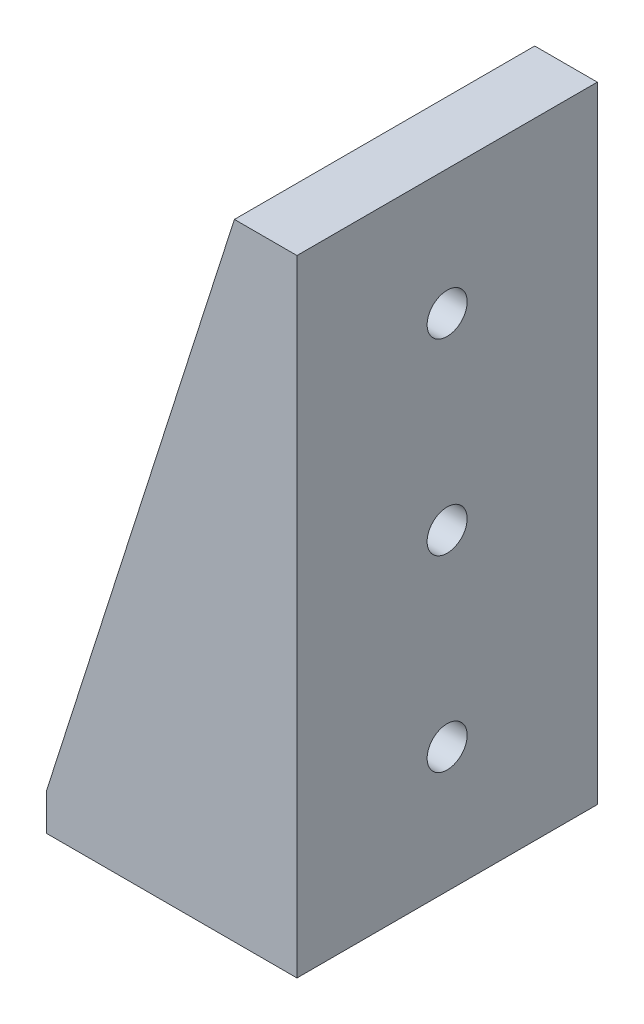
ISO-10303-21;
HEADER;
FILE_DESCRIPTION(('STEP AP214'),'2;1');
FILE_NAME('part.step','',(''),(''),'','','');
FILE_SCHEMA(('AUTOMOTIVE_DESIGN { 1 0 10303 214 1 1 1 1 }'));
ENDSEC;
DATA;
#1=APPLICATION_CONTEXT('core data for automotive mechanical design processes');
#2=APPLICATION_PROTOCOL_DEFINITION('international standard','automotive_design',2000,#1);
#3=PRODUCT_CONTEXT('',#1,'mechanical');
#4=PRODUCT('Part','Part','',(#3));
#5=PRODUCT_RELATED_PRODUCT_CATEGORY('part','',(#4));
#6=PRODUCT_DEFINITION_FORMATION('','',#4);
#7=PRODUCT_DEFINITION_CONTEXT('part definition',#1,'design');
#8=PRODUCT_DEFINITION('design','',#6,#7);
#9=PRODUCT_DEFINITION_SHAPE('','',#8);
#10=(LENGTH_UNIT() NAMED_UNIT(*) SI_UNIT(.MILLI.,.METRE.));
#11=(NAMED_UNIT(*) PLANE_ANGLE_UNIT() SI_UNIT($,.RADIAN.));
#12=(NAMED_UNIT(*) SI_UNIT($,.STERADIAN.) SOLID_ANGLE_UNIT());
#13=UNCERTAINTY_MEASURE_WITH_UNIT(LENGTH_MEASURE(1.E-05),#10,'distance_accuracy_value','');
#14=(GEOMETRIC_REPRESENTATION_CONTEXT(3) GLOBAL_UNCERTAINTY_ASSIGNED_CONTEXT((#13)) GLOBAL_UNIT_ASSIGNED_CONTEXT((#10,
#11,#12)) REPRESENTATION_CONTEXT('',''));
#15=CARTESIAN_POINT('',(0.,0.,0.));
#16=DIRECTION('',(0.,0.,1.));
#17=DIRECTION('',(1.,0.,0.));
#18=AXIS2_PLACEMENT_3D('',#15,#16,#17);
#19=CARTESIAN_POINT('',(-10.,3.,24.));
#20=DIRECTION('',(0.952659211218683,-0.304040173793197,0.));
#21=DIRECTION('',(0.304040173793197,0.952659211218683,0.));
#22=AXIS2_PLACEMENT_3D('',#19,#20,#21);
#23=PLANE('',#22);
#24=DIRECTION('',(0.,0.,-1.));
#25=VECTOR('',#24,1.);
#26=CARTESIAN_POINT('',(5.,50.,24.));
#27=LINE('',#26,#25);
#28=CARTESIAN_POINT('',(5.,50.,24.));
#29=VERTEX_POINT('',#28);
#30=CARTESIAN_POINT('',(5.,50.,21.5));
#31=VERTEX_POINT('',#30);
#32=EDGE_CURVE('E255',#29,#31,#27,.T.);
#33=ORIENTED_EDGE('',*,*,#32,.T.);
#34=DIRECTION('',(-0.304040173793197,-0.952659211218683,0.));
#35=VECTOR('',#34,1.);
#36=CARTESIAN_POINT('',(-10.,3.,21.5));
#37=LINE('',#36,#35);
#38=CARTESIAN_POINT('',(-9.68128901761478,3.99862774480702,21.5));
#39=VERTEX_POINT('',#38);
#40=EDGE_CURVE('E221',#31,#39,#37,.T.);
#41=ORIENTED_EDGE('',*,*,#40,.T.);
#42=CARTESIAN_POINT('',(-9.68128901761478,3.99862774480702,20.5));
#43=DIRECTION('',(0.952659211218683,-0.304040173793197,0.));
#44=DIRECTION('',(0.304040173793197,0.952659211218683,0.));
#45=AXIS2_PLACEMENT_3D('',#42,#43,#44);
#46=ELLIPSE('',#45,1.04969330923779,1.);
#47=CARTESIAN_POINT('',(-10.,3.,20.5523700993091));
#48=VERTEX_POINT('',#47);
#49=EDGE_CURVE('E275',#39,#48,#46,.T.);
#50=ORIENTED_EDGE('',*,*,#49,.T.);
#51=DIRECTION('',(0.,0.,-1.));
#52=VECTOR('',#51,1.);
#53=CARTESIAN_POINT('',(-10.,3.,24.));
#54=LINE('',#53,#52);
#55=CARTESIAN_POINT('',(-10.,3.,24.));
#56=VERTEX_POINT('',#55);
#57=EDGE_CURVE('E60',#56,#48,#54,.T.);
#58=ORIENTED_EDGE('',*,*,#57,.F.);
#59=DIRECTION('',(-0.304040173793197,-0.952659211218683,0.));
#60=VECTOR('',#59,1.);
#61=CARTESIAN_POINT('',(-10.,3.,24.));
#62=LINE('',#61,#60);
#63=EDGE_CURVE('E231',#29,#56,#62,.T.);
#64=ORIENTED_EDGE('',*,*,#63,.F.);
#65=EDGE_LOOP('',(#33,#41,#50,#58,#64));
#66=FACE_BOUND('',#65,.T.);
#67=ADVANCED_FACE('F36',(#66),#23,.F.);
#68=CARTESIAN_POINT('',(10.,0.,24.));
#69=DIRECTION('',(-1.,0.,0.));
#70=DIRECTION('',(0.,0.,1.));
#71=AXIS2_PLACEMENT_3D('',#68,#69,#70);
#72=PLANE('',#71);
#73=CARTESIAN_POINT('',(10.,10.,12.));
#74=DIRECTION('',(1.,0.,0.));
#75=DIRECTION('',(0.,0.,-1.));
#76=AXIS2_PLACEMENT_3D('',#73,#74,#75);
#77=CIRCLE('',#76,1.6);
#78=CARTESIAN_POINT('',(10.,10.,10.4));
#79=VERTEX_POINT('',#78);
#80=EDGE_CURVE('E190',#79,#79,#77,.T.);
#81=ORIENTED_EDGE('',*,*,#80,.F.);
#82=EDGE_LOOP('',(#81));
#83=FACE_BOUND('',#82,.T.);
#84=CARTESIAN_POINT('',(10.,25.,12.));
#85=DIRECTION('',(1.,0.,0.));
#86=DIRECTION('',(0.,0.,-1.));
#87=AXIS2_PLACEMENT_3D('',#84,#85,#86);
#88=CIRCLE('',#87,1.6);
#89=CARTESIAN_POINT('',(10.,25.,10.4));
#90=VERTEX_POINT('',#89);
#91=EDGE_CURVE('E197',#90,#90,#88,.T.);
#92=ORIENTED_EDGE('',*,*,#91,.F.);
#93=EDGE_LOOP('',(#92));
#94=FACE_BOUND('',#93,.T.);
#95=CARTESIAN_POINT('',(10.,40.,12.));
#96=DIRECTION('',(1.,0.,0.));
#97=DIRECTION('',(0.,0.,-1.));
#98=AXIS2_PLACEMENT_3D('',#95,#96,#97);
#99=CIRCLE('',#98,1.6);
#100=CARTESIAN_POINT('',(10.,40.,10.4));
#101=VERTEX_POINT('',#100);
#102=EDGE_CURVE('E203',#101,#101,#99,.T.);
#103=ORIENTED_EDGE('',*,*,#102,.F.);
#104=EDGE_LOOP('',(#103));
#105=FACE_BOUND('',#104,.T.);
#106=DIRECTION('',(0.,1.,0.));
#107=VECTOR('',#106,1.);
#108=CARTESIAN_POINT('',(10.,0.,0.));
#109=LINE('',#108,#107);
#110=CARTESIAN_POINT('',(10.,0.,0.));
#111=VERTEX_POINT('',#110);
#112=CARTESIAN_POINT('',(10.,50.,0.));
#113=VERTEX_POINT('',#112);
#114=EDGE_CURVE('E224',#111,#113,#109,.T.);
#115=ORIENTED_EDGE('',*,*,#114,.T.);
#116=DIRECTION('',(0.,0.,-1.));
#117=VECTOR('',#116,1.);
#118=CARTESIAN_POINT('',(10.,50.,24.));
#119=LINE('',#118,#117);
#120=CARTESIAN_POINT('',(10.,50.,24.));
#121=VERTEX_POINT('',#120);
#122=EDGE_CURVE('E258',#121,#113,#119,.T.);
#123=ORIENTED_EDGE('',*,*,#122,.F.);
#124=DIRECTION('',(0.,1.,0.));
#125=VECTOR('',#124,1.);
#126=CARTESIAN_POINT('',(10.,0.,24.));
#127=LINE('',#126,#125);
#128=CARTESIAN_POINT('',(10.,0.,24.));
#129=VERTEX_POINT('',#128);
#130=EDGE_CURVE('E225',#129,#121,#127,.T.);
#131=ORIENTED_EDGE('',*,*,#130,.F.);
#132=DIRECTION('',(0.,0.,-1.));
#133=VECTOR('',#132,1.);
#134=CARTESIAN_POINT('',(10.,0.,24.));
#135=LINE('',#134,#133);
#136=EDGE_CURVE('E237',#129,#111,#135,.T.);
#137=ORIENTED_EDGE('',*,*,#136,.T.);
#138=EDGE_LOOP('',(#115,#123,#131,#137));
#139=FACE_BOUND('',#138,.T.);
#140=ADVANCED_FACE('F335',(#83,#94,#105,#139),#72,.F.);
#141=CARTESIAN_POINT('',(5.,50.,24.));
#142=DIRECTION('',(0.,-1.,0.));
#143=DIRECTION('',(0.,0.,-1.));
#144=AXIS2_PLACEMENT_3D('',#141,#142,#143);
#145=PLANE('',#144);
#146=DIRECTION('',(-1.,0.,0.));
#147=VECTOR('',#146,1.);
#148=CARTESIAN_POINT('',(5.,50.,0.));
#149=LINE('',#148,#147);
#150=CARTESIAN_POINT('',(5.,50.,0.));
#151=VERTEX_POINT('',#150);
#152=EDGE_CURVE('E240',#113,#151,#149,.T.);
#153=ORIENTED_EDGE('',*,*,#152,.T.);
#154=CARTESIAN_POINT('',(5.,50.,2.5));
#155=VERTEX_POINT('',#154);
#156=EDGE_CURVE('E254',#155,#151,#27,.T.);
#157=ORIENTED_EDGE('',*,*,#156,.F.);
#158=DIRECTION('',(0.,0.,-1.));
#159=VECTOR('',#158,1.);
#160=CARTESIAN_POINT('',(5.,50.,2.5));
#161=LINE('',#160,#159);
#162=EDGE_CURVE('E210',#31,#155,#161,.T.);
#163=ORIENTED_EDGE('',*,*,#162,.F.);
#164=ORIENTED_EDGE('',*,*,#32,.F.);
#165=DIRECTION('',(-1.,0.,0.));
#166=VECTOR('',#165,1.);
#167=CARTESIAN_POINT('',(5.,50.,24.));
#168=LINE('',#167,#166);
#169=EDGE_CURVE('E228',#121,#29,#168,.T.);
#170=ORIENTED_EDGE('',*,*,#169,.F.);
#171=ORIENTED_EDGE('',*,*,#122,.T.);
#172=EDGE_LOOP('',(#153,#157,#163,#164,#170,#171));
#173=FACE_BOUND('',#172,.T.);
#174=ADVANCED_FACE('F325',(#173),#145,.F.);
#175=CARTESIAN_POINT('',(-10.,3.,3.44762990069088));
#176=VERTEX_POINT('',#175);
#177=CARTESIAN_POINT('',(-10.,3.,0.));
#178=VERTEX_POINT('',#177);
#179=EDGE_CURVE('E52',#176,#178,#54,.T.);
#180=ORIENTED_EDGE('',*,*,#179,.F.);
#181=CARTESIAN_POINT('',(-9.68128901761478,3.99862774480702,3.5));
#182=DIRECTION('',(0.952659211218683,-0.304040173793197,0.));
#183=DIRECTION('',(0.304040173793197,0.952659211218683,0.));
#184=AXIS2_PLACEMENT_3D('',#181,#182,#183);
#185=ELLIPSE('',#184,1.04969330923779,1.);
#186=CARTESIAN_POINT('',(-9.68128901761478,3.99862774480702,2.5));
#187=VERTEX_POINT('',#186);
#188=EDGE_CURVE('E11',#176,#187,#185,.T.);
#189=ORIENTED_EDGE('',*,*,#188,.T.);
#190=DIRECTION('',(0.304040173793197,0.952659211218683,0.));
#191=VECTOR('',#190,1.);
#192=CARTESIAN_POINT('',(-10.,3.,2.5));
#193=LINE('',#192,#191);
#194=EDGE_CURVE('E218',#187,#155,#193,.T.);
#195=ORIENTED_EDGE('',*,*,#194,.T.);
#196=ORIENTED_EDGE('',*,*,#156,.T.);
#197=DIRECTION('',(-0.304040173793197,-0.952659211218683,0.));
#198=VECTOR('',#197,1.);
#199=CARTESIAN_POINT('',(-10.,3.,0.));
#200=LINE('',#199,#198);
#201=EDGE_CURVE('E243',#151,#178,#200,.T.);
#202=ORIENTED_EDGE('',*,*,#201,.T.);
#203=EDGE_LOOP('',(#180,#189,#195,#196,#202));
#204=FACE_BOUND('',#203,.T.);
#205=ADVANCED_FACE('F341',(#204),#23,.F.);
#206=CARTESIAN_POINT('',(-10.,0.,24.));
#207=DIRECTION('',(1.,0.,0.));
#208=DIRECTION('',(0.,0.,-1.));
#209=AXIS2_PLACEMENT_3D('',#206,#207,#208);
#210=PLANE('',#209);
#211=ORIENTED_EDGE('',*,*,#57,.T.);
#212=CARTESIAN_POINT('',(-10.,3.99862774480702,20.5));
#213=DIRECTION('',(1.,0.,0.));
#214=DIRECTION('',(0.,0.,-1.));
#215=AXIS2_PLACEMENT_3D('',#212,#213,#214);
#216=CIRCLE('',#215,1.);
#217=CARTESIAN_POINT('',(-10.,2.99862774480702,20.5));
#218=VERTEX_POINT('',#217);
#219=EDGE_CURVE('E277',#48,#218,#216,.T.);
#220=ORIENTED_EDGE('',*,*,#219,.T.);
#221=DIRECTION('',(0.,0.,1.));
#222=VECTOR('',#221,1.);
#223=CARTESIAN_POINT('',(-10.,2.99862774480702,2.5));
#224=LINE('',#223,#222);
#225=CARTESIAN_POINT('',(-10.,2.99862774480702,3.5));
#226=VERTEX_POINT('',#225);
#227=EDGE_CURVE('E209',#226,#218,#224,.T.);
#228=ORIENTED_EDGE('',*,*,#227,.F.);
#229=CARTESIAN_POINT('',(-10.,3.99862774480702,3.5));
#230=DIRECTION('',(1.,0.,0.));
#231=DIRECTION('',(0.,0.,-1.));
#232=AXIS2_PLACEMENT_3D('',#229,#230,#231);
#233=CIRCLE('',#232,1.);
#234=EDGE_CURVE('E45',#226,#176,#233,.T.);
#235=ORIENTED_EDGE('',*,*,#234,.T.);
#236=ORIENTED_EDGE('',*,*,#179,.T.);
#237=DIRECTION('',(0.,-1.,0.));
#238=VECTOR('',#237,1.);
#239=CARTESIAN_POINT('',(-10.,0.,0.));
#240=LINE('',#239,#238);
#241=CARTESIAN_POINT('',(-10.,0.,0.));
#242=VERTEX_POINT('',#241);
#243=EDGE_CURVE('E245',#178,#242,#240,.T.);
#244=ORIENTED_EDGE('',*,*,#243,.T.);
#245=DIRECTION('',(0.,0.,-1.));
#246=VECTOR('',#245,1.);
#247=CARTESIAN_POINT('',(-10.,0.,24.));
#248=LINE('',#247,#246);
#249=CARTESIAN_POINT('',(-10.,0.,24.));
#250=VERTEX_POINT('',#249);
#251=EDGE_CURVE('E250',#250,#242,#248,.T.);
#252=ORIENTED_EDGE('',*,*,#251,.F.);
#253=DIRECTION('',(0.,-1.,0.));
#254=VECTOR('',#253,1.);
#255=CARTESIAN_POINT('',(-10.,0.,24.));
#256=LINE('',#255,#254);
#257=EDGE_CURVE('E233',#56,#250,#256,.T.);
#258=ORIENTED_EDGE('',*,*,#257,.F.);
#259=EDGE_LOOP('',(#211,#220,#228,#235,#236,#244,#252,#258));
#260=FACE_BOUND('',#259,.T.);
#261=ADVANCED_FACE('F307',(#260),#210,.F.);
#262=CARTESIAN_POINT('',(-10.,0.,24.));
#263=DIRECTION('',(0.,1.,0.));
#264=DIRECTION('',(-1.,0.,0.));
#265=AXIS2_PLACEMENT_3D('',#262,#263,#264);
#266=PLANE('',#265);
#267=DIRECTION('',(1.,0.,0.));
#268=VECTOR('',#267,1.);
#269=CARTESIAN_POINT('',(-7.,0.,11.));
#270=LINE('',#269,#268);
#271=CARTESIAN_POINT('',(-7.,0.,11.));
#272=VERTEX_POINT('',#271);
#273=CARTESIAN_POINT('',(3.,0.,11.));
#274=VERTEX_POINT('',#273);
#275=EDGE_CURVE('E289',#272,#274,#270,.T.);
#276=ORIENTED_EDGE('',*,*,#275,.F.);
#277=CARTESIAN_POINT('',(-7.,0.,12.));
#278=DIRECTION('',(0.,1.,0.));
#279=DIRECTION('',(-1.,0.,0.));
#280=AXIS2_PLACEMENT_3D('',#277,#278,#279);
#281=CIRCLE('',#280,1.);
#282=CARTESIAN_POINT('',(-7.,0.,13.));
#283=VERTEX_POINT('',#282);
#284=EDGE_CURVE('E191',#283,#272,#281,.F.);
#285=ORIENTED_EDGE('',*,*,#284,.F.);
#286=DIRECTION('',(-1.,0.,0.));
#287=VECTOR('',#286,1.);
#288=CARTESIAN_POINT('',(-7.,0.,13.));
#289=LINE('',#288,#287);
#290=CARTESIAN_POINT('',(3.,0.,13.));
#291=VERTEX_POINT('',#290);
#292=EDGE_CURVE('E188',#291,#283,#289,.T.);
#293=ORIENTED_EDGE('',*,*,#292,.F.);
#294=CARTESIAN_POINT('',(3.,0.,12.));
#295=DIRECTION('',(0.,1.,0.));
#296=DIRECTION('',(-1.,0.,0.));
#297=AXIS2_PLACEMENT_3D('',#294,#295,#296);
#298=CIRCLE('',#297,1.);
#299=EDGE_CURVE('E156',#274,#291,#298,.F.);
#300=ORIENTED_EDGE('',*,*,#299,.F.);
#301=EDGE_LOOP('',(#276,#285,#293,#300));
#302=FACE_BOUND('',#301,.T.);
#303=DIRECTION('',(1.,0.,0.));
#304=VECTOR('',#303,1.);
#305=CARTESIAN_POINT('',(-10.,0.,0.));
#306=LINE('',#305,#304);
#307=EDGE_CURVE('E229',#242,#111,#306,.T.);
#308=ORIENTED_EDGE('',*,*,#307,.T.);
#309=ORIENTED_EDGE('',*,*,#136,.F.);
#310=DIRECTION('',(1.,0.,0.));
#311=VECTOR('',#310,1.);
#312=CARTESIAN_POINT('',(-10.,0.,24.));
#313=LINE('',#312,#311);
#314=EDGE_CURVE('E235',#250,#129,#313,.T.);
#315=ORIENTED_EDGE('',*,*,#314,.F.);
#316=ORIENTED_EDGE('',*,*,#251,.T.);
#317=EDGE_LOOP('',(#308,#309,#315,#316));
#318=FACE_BOUND('',#317,.T.);
#319=ADVANCED_FACE('F298',(#302,#318),#266,.F.);
#320=CARTESIAN_POINT('',(0.,0.,24.));
#321=DIRECTION('',(0.,0.,-1.));
#322=DIRECTION('',(-1.,0.,0.));
#323=AXIS2_PLACEMENT_3D('',#320,#321,#322);
#324=PLANE('',#323);
#325=ORIENTED_EDGE('',*,*,#130,.T.);
#326=ORIENTED_EDGE('',*,*,#169,.T.);
#327=ORIENTED_EDGE('',*,*,#63,.T.);
#328=ORIENTED_EDGE('',*,*,#257,.T.);
#329=ORIENTED_EDGE('',*,*,#314,.T.);
#330=EDGE_LOOP('',(#325,#326,#327,#328,#329));
#331=FACE_BOUND('',#330,.T.);
#332=ADVANCED_FACE('F328',(#331),#324,.F.);
#333=CARTESIAN_POINT('',(0.,0.,0.));
#334=DIRECTION('',(0.,0.,-1.));
#335=DIRECTION('',(-1.,0.,0.));
#336=AXIS2_PLACEMENT_3D('',#333,#334,#335);
#337=PLANE('',#336);
#338=ORIENTED_EDGE('',*,*,#114,.F.);
#339=ORIENTED_EDGE('',*,*,#307,.F.);
#340=ORIENTED_EDGE('',*,*,#243,.F.);
#341=ORIENTED_EDGE('',*,*,#201,.F.);
#342=ORIENTED_EDGE('',*,*,#152,.F.);
#343=EDGE_LOOP('',(#338,#339,#340,#341,#342));
#344=FACE_BOUND('',#343,.T.);
#345=ADVANCED_FACE('F339',(#344),#337,.T.);
#346=CARTESIAN_POINT('',(5.,2.99862774480702,21.5));
#347=DIRECTION('',(0.,0.,1.));
#348=DIRECTION('',(1.,0.,0.));
#349=AXIS2_PLACEMENT_3D('',#346,#347,#348);
#350=PLANE('',#349);
#351=DIRECTION('',(0.,1.,0.));
#352=VECTOR('',#351,1.);
#353=CARTESIAN_POINT('',(5.,2.99862774480702,21.5));
#354=LINE('',#353,#352);
#355=CARTESIAN_POINT('',(5.,3.99862774480702,21.5));
#356=VERTEX_POINT('',#355);
#357=EDGE_CURVE('E216',#356,#31,#354,.T.);
#358=ORIENTED_EDGE('',*,*,#357,.F.);
#359=DIRECTION('',(-1.,0.,0.));
#360=VECTOR('',#359,1.);
#361=CARTESIAN_POINT('',(-10.,3.99862774480702,21.5));
#362=LINE('',#361,#360);
#363=EDGE_CURVE('E271',#356,#39,#362,.T.);
#364=ORIENTED_EDGE('',*,*,#363,.T.);
#365=ORIENTED_EDGE('',*,*,#40,.F.);
#366=EDGE_LOOP('',(#358,#364,#365));
#367=FACE_BOUND('',#366,.T.);
#368=ADVANCED_FACE('F319',(#367),#350,.F.);
#369=CARTESIAN_POINT('',(5.,50.,2.5));
#370=DIRECTION('',(0.,0.,-1.));
#371=DIRECTION('',(0.,1.,0.));
#372=AXIS2_PLACEMENT_3D('',#369,#370,#371);
#373=PLANE('',#372);
#374=ORIENTED_EDGE('',*,*,#194,.F.);
#375=DIRECTION('',(-1.,0.,0.));
#376=VECTOR('',#375,1.);
#377=CARTESIAN_POINT('',(5.,3.99862774480702,2.5));
#378=LINE('',#377,#376);
#379=CARTESIAN_POINT('',(5.,3.99862774480702,2.5));
#380=VERTEX_POINT('',#379);
#381=EDGE_CURVE('E273',#187,#380,#378,.F.);
#382=ORIENTED_EDGE('',*,*,#381,.T.);
#383=DIRECTION('',(0.,-1.,0.));
#384=VECTOR('',#383,1.);
#385=CARTESIAN_POINT('',(5.,50.,2.5));
#386=LINE('',#385,#384);
#387=EDGE_CURVE('E213',#155,#380,#386,.T.);
#388=ORIENTED_EDGE('',*,*,#387,.F.);
#389=EDGE_LOOP('',(#374,#382,#388));
#390=FACE_BOUND('',#389,.T.);
#391=ADVANCED_FACE('F344',(#390),#373,.F.);
#392=CARTESIAN_POINT('',(5.,2.99862774480702,2.5));
#393=DIRECTION('',(0.,-1.,0.));
#394=DIRECTION('',(0.,0.,-1.));
#395=AXIS2_PLACEMENT_3D('',#392,#393,#394);
#396=PLANE('',#395);
#397=ORIENTED_EDGE('',*,*,#227,.T.);
#398=DIRECTION('',(-1.,0.,0.));
#399=VECTOR('',#398,1.);
#400=CARTESIAN_POINT('',(5.,2.99862774480702,20.5));
#401=LINE('',#400,#399);
#402=CARTESIAN_POINT('',(4.,2.99862774480702,20.5));
#403=VERTEX_POINT('',#402);
#404=EDGE_CURVE('E269',#218,#403,#401,.F.);
#405=ORIENTED_EDGE('',*,*,#404,.T.);
#406=DIRECTION('',(0.,0.,1.));
#407=VECTOR('',#406,1.);
#408=CARTESIAN_POINT('',(4.,2.99862774480702,2.5));
#409=LINE('',#408,#407);
#410=CARTESIAN_POINT('',(4.,2.99862774480702,12.));
#411=VERTEX_POINT('',#410);
#412=EDGE_CURVE('E175',#403,#411,#409,.F.);
#413=ORIENTED_EDGE('',*,*,#412,.T.);
#414=CARTESIAN_POINT('',(3.,2.99862774480702,12.));
#415=DIRECTION('',(0.,1.,0.));
#416=DIRECTION('',(0.,0.,1.));
#417=AXIS2_PLACEMENT_3D('',#414,#415,#416);
#418=CIRCLE('',#417,1.);
#419=CARTESIAN_POINT('',(3.,2.99862774480702,13.));
#420=VERTEX_POINT('',#419);
#421=EDGE_CURVE('E152',#420,#411,#418,.T.);
#422=ORIENTED_EDGE('',*,*,#421,.F.);
#423=DIRECTION('',(1.,0.,0.));
#424=VECTOR('',#423,1.);
#425=CARTESIAN_POINT('',(-7.,2.99862774480702,13.));
#426=LINE('',#425,#424);
#427=CARTESIAN_POINT('',(-7.,2.99862774480702,13.));
#428=VERTEX_POINT('',#427);
#429=EDGE_CURVE('E164',#428,#420,#426,.T.);
#430=ORIENTED_EDGE('',*,*,#429,.F.);
#431=CARTESIAN_POINT('',(-7.,2.99862774480702,12.));
#432=DIRECTION('',(0.,1.,0.));
#433=DIRECTION('',(0.,0.,1.));
#434=AXIS2_PLACEMENT_3D('',#431,#432,#433);
#435=CIRCLE('',#434,1.);
#436=CARTESIAN_POINT('',(-7.,2.99862774480702,11.));
#437=VERTEX_POINT('',#436);
#438=EDGE_CURVE('E170',#437,#428,#435,.T.);
#439=ORIENTED_EDGE('',*,*,#438,.F.);
#440=DIRECTION('',(-1.,0.,0.));
#441=VECTOR('',#440,1.);
#442=CARTESIAN_POINT('',(-7.,2.99862774480702,11.));
#443=LINE('',#442,#441);
#444=CARTESIAN_POINT('',(3.,2.99862774480702,11.));
#445=VERTEX_POINT('',#444);
#446=EDGE_CURVE('E177',#445,#437,#443,.T.);
#447=ORIENTED_EDGE('',*,*,#446,.F.);
#448=EDGE_CURVE('E169',#411,#445,#418,.T.);
#449=ORIENTED_EDGE('',*,*,#448,.F.);
#450=DIRECTION('',(0.,0.,1.));
#451=VECTOR('',#450,1.);
#452=CARTESIAN_POINT('',(4.,2.99862774480702,2.5));
#453=LINE('',#452,#451);
#454=CARTESIAN_POINT('',(4.,2.99862774480702,3.5));
#455=VERTEX_POINT('',#454);
#456=EDGE_CURVE('E266',#411,#455,#453,.F.);
#457=ORIENTED_EDGE('',*,*,#456,.T.);
#458=DIRECTION('',(-1.,0.,0.));
#459=VECTOR('',#458,1.);
#460=CARTESIAN_POINT('',(-10.,2.99862774480702,3.5));
#461=LINE('',#460,#459);
#462=EDGE_CURVE('E264',#455,#226,#461,.T.);
#463=ORIENTED_EDGE('',*,*,#462,.T.);
#464=EDGE_LOOP('',(#397,#405,#413,#422,#430,#439,#447,#449,#457,#463));
#465=FACE_BOUND('',#464,.T.);
#466=ADVANCED_FACE('F173',(#465),#396,.F.);
#467=CARTESIAN_POINT('',(5.,0.,0.));
#468=DIRECTION('',(-1.,0.,0.));
#469=DIRECTION('',(0.,0.,1.));
#470=AXIS2_PLACEMENT_3D('',#467,#468,#469);
#471=PLANE('',#470);
#472=CARTESIAN_POINT('',(5.,10.,12.));
#473=DIRECTION('',(-1.,0.,0.));
#474=DIRECTION('',(0.,0.,1.));
#475=AXIS2_PLACEMENT_3D('',#472,#473,#474);
#476=CIRCLE('',#475,1.6);
#477=CARTESIAN_POINT('',(5.,10.,13.6));
#478=VERTEX_POINT('',#477);
#479=EDGE_CURVE('E194',#478,#478,#476,.F.);
#480=ORIENTED_EDGE('',*,*,#479,.T.);
#481=EDGE_LOOP('',(#480));
#482=FACE_BOUND('',#481,.T.);
#483=CARTESIAN_POINT('',(5.,25.,12.));
#484=DIRECTION('',(-1.,0.,0.));
#485=DIRECTION('',(0.,0.,1.));
#486=AXIS2_PLACEMENT_3D('',#483,#484,#485);
#487=CIRCLE('',#486,1.6);
#488=CARTESIAN_POINT('',(5.,25.,13.6));
#489=VERTEX_POINT('',#488);
#490=EDGE_CURVE('E200',#489,#489,#487,.F.);
#491=ORIENTED_EDGE('',*,*,#490,.T.);
#492=EDGE_LOOP('',(#491));
#493=FACE_BOUND('',#492,.T.);
#494=CARTESIAN_POINT('',(5.,40.,12.));
#495=DIRECTION('',(-1.,0.,0.));
#496=DIRECTION('',(0.,0.,1.));
#497=AXIS2_PLACEMENT_3D('',#494,#495,#496);
#498=CIRCLE('',#497,1.6);
#499=CARTESIAN_POINT('',(5.,40.,13.6));
#500=VERTEX_POINT('',#499);
#501=EDGE_CURVE('E206',#500,#500,#498,.F.);
#502=ORIENTED_EDGE('',*,*,#501,.T.);
#503=EDGE_LOOP('',(#502));
#504=FACE_BOUND('',#503,.T.);
#505=ORIENTED_EDGE('',*,*,#387,.T.);
#506=DIRECTION('',(0.,0.,1.));
#507=VECTOR('',#506,1.);
#508=CARTESIAN_POINT('',(5.,3.99862774480702,0.));
#509=LINE('',#508,#507);
#510=EDGE_CURVE('E261',#380,#356,#509,.T.);
#511=ORIENTED_EDGE('',*,*,#510,.T.);
#512=ORIENTED_EDGE('',*,*,#357,.T.);
#513=ORIENTED_EDGE('',*,*,#162,.T.);
#514=EDGE_LOOP('',(#505,#511,#512,#513));
#515=FACE_BOUND('',#514,.T.);
#516=ADVANCED_FACE('F317',(#482,#493,#504,#515),#471,.T.);
#517=CARTESIAN_POINT('',(0.474516600406092,40.,12.));
#518=DIRECTION('',(1.,0.,0.));
#519=DIRECTION('',(0.,0.,-1.));
#520=AXIS2_PLACEMENT_3D('',#517,#518,#519);
#521=CYLINDRICAL_SURFACE('',#520,1.6);
#522=ORIENTED_EDGE('',*,*,#102,.T.);
#523=EDGE_LOOP('',(#522));
#524=FACE_BOUND('',#523,.T.);
#525=ORIENTED_EDGE('',*,*,#501,.F.);
#526=EDGE_LOOP('',(#525));
#527=FACE_BOUND('',#526,.T.);
#528=ADVANCED_FACE('F396',(#524,#527),#521,.F.);
#529=CARTESIAN_POINT('',(0.474516600406092,25.,12.));
#530=DIRECTION('',(1.,0.,0.));
#531=DIRECTION('',(0.,0.,-1.));
#532=AXIS2_PLACEMENT_3D('',#529,#530,#531);
#533=CYLINDRICAL_SURFACE('',#532,1.6);
#534=ORIENTED_EDGE('',*,*,#91,.T.);
#535=EDGE_LOOP('',(#534));
#536=FACE_BOUND('',#535,.T.);
#537=ORIENTED_EDGE('',*,*,#490,.F.);
#538=EDGE_LOOP('',(#537));
#539=FACE_BOUND('',#538,.T.);
#540=ADVANCED_FACE('F392',(#536,#539),#533,.F.);
#541=CARTESIAN_POINT('',(0.474516600406092,10.,12.));
#542=DIRECTION('',(1.,0.,0.));
#543=DIRECTION('',(0.,0.,-1.));
#544=AXIS2_PLACEMENT_3D('',#541,#542,#543);
#545=CYLINDRICAL_SURFACE('',#544,1.6);
#546=ORIENTED_EDGE('',*,*,#80,.T.);
#547=EDGE_LOOP('',(#546));
#548=FACE_BOUND('',#547,.T.);
#549=ORIENTED_EDGE('',*,*,#479,.F.);
#550=EDGE_LOOP('',(#549));
#551=FACE_BOUND('',#550,.T.);
#552=ADVANCED_FACE('F389',(#548,#551),#545,.F.);
#553=CARTESIAN_POINT('',(-7.,-12.1655250605964,12.));
#554=DIRECTION('',(0.,1.,0.));
#555=DIRECTION('',(0.,0.,1.));
#556=AXIS2_PLACEMENT_3D('',#553,#554,#555);
#557=CYLINDRICAL_SURFACE('',#556,1.);
#558=ORIENTED_EDGE('',*,*,#284,.T.);
#559=DIRECTION('',(0.,1.,0.));
#560=VECTOR('',#559,1.);
#561=CARTESIAN_POINT('',(-7.,-12.1655250605964,11.));
#562=LINE('',#561,#560);
#563=EDGE_CURVE('E183',#272,#437,#562,.T.);
#564=ORIENTED_EDGE('',*,*,#563,.T.);
#565=ORIENTED_EDGE('',*,*,#438,.T.);
#566=DIRECTION('',(0.,1.,0.));
#567=VECTOR('',#566,1.);
#568=CARTESIAN_POINT('',(-7.,-12.1655250605964,13.));
#569=LINE('',#568,#567);
#570=EDGE_CURVE('E160',#283,#428,#569,.T.);
#571=ORIENTED_EDGE('',*,*,#570,.F.);
#572=EDGE_LOOP('',(#558,#564,#565,#571));
#573=FACE_BOUND('',#572,.T.);
#574=ADVANCED_FACE('F300',(#573),#557,.F.);
#575=CARTESIAN_POINT('',(-7.,-12.1655250605964,11.));
#576=DIRECTION('',(0.,0.,-1.));
#577=DIRECTION('',(-1.,0.,0.));
#578=AXIS2_PLACEMENT_3D('',#575,#576,#577);
#579=PLANE('',#578);
#580=ORIENTED_EDGE('',*,*,#275,.T.);
#581=DIRECTION('',(0.,1.,0.));
#582=VECTOR('',#581,1.);
#583=CARTESIAN_POINT('',(3.,-12.1655250605964,11.));
#584=LINE('',#583,#582);
#585=EDGE_CURVE('E159',#274,#445,#584,.T.);
#586=ORIENTED_EDGE('',*,*,#585,.T.);
#587=ORIENTED_EDGE('',*,*,#446,.T.);
#588=ORIENTED_EDGE('',*,*,#563,.F.);
#589=EDGE_LOOP('',(#580,#586,#587,#588));
#590=FACE_BOUND('',#589,.T.);
#591=ADVANCED_FACE('F294',(#590),#579,.F.);
#592=CARTESIAN_POINT('',(3.,-12.1655250605964,12.));
#593=DIRECTION('',(0.,1.,0.));
#594=DIRECTION('',(0.,0.,1.));
#595=AXIS2_PLACEMENT_3D('',#592,#593,#594);
#596=CYLINDRICAL_SURFACE('',#595,1.);
#597=ORIENTED_EDGE('',*,*,#299,.T.);
#598=DIRECTION('',(0.,1.,0.));
#599=VECTOR('',#598,1.);
#600=CARTESIAN_POINT('',(3.,-12.1655250605964,13.));
#601=LINE('',#600,#599);
#602=EDGE_CURVE('E148',#291,#420,#601,.T.);
#603=ORIENTED_EDGE('',*,*,#602,.T.);
#604=ORIENTED_EDGE('',*,*,#421,.T.);
#605=ORIENTED_EDGE('',*,*,#448,.T.);
#606=ORIENTED_EDGE('',*,*,#585,.F.);
#607=EDGE_LOOP('',(#597,#603,#604,#605,#606));
#608=FACE_BOUND('',#607,.T.);
#609=ADVANCED_FACE('F150',(#608),#596,.F.);
#610=CARTESIAN_POINT('',(-7.,-12.1655250605964,13.));
#611=DIRECTION('',(0.,0.,1.));
#612=DIRECTION('',(1.,0.,0.));
#613=AXIS2_PLACEMENT_3D('',#610,#611,#612);
#614=PLANE('',#613);
#615=ORIENTED_EDGE('',*,*,#292,.T.);
#616=ORIENTED_EDGE('',*,*,#570,.T.);
#617=ORIENTED_EDGE('',*,*,#429,.T.);
#618=ORIENTED_EDGE('',*,*,#602,.F.);
#619=EDGE_LOOP('',(#615,#616,#617,#618));
#620=FACE_BOUND('',#619,.T.);
#621=ADVANCED_FACE('F165',(#620),#614,.F.);
#622=CARTESIAN_POINT('',(5.,3.99862774480702,3.5));
#623=DIRECTION('',(1.,0.,0.));
#624=DIRECTION('',(0.,0.,-1.));
#625=AXIS2_PLACEMENT_3D('',#622,#623,#624);
#626=CYLINDRICAL_SURFACE('',#625,1.);
#627=ORIENTED_EDGE('',*,*,#234,.F.);
#628=ORIENTED_EDGE('',*,*,#462,.F.);
#629=CARTESIAN_POINT('',(4.,3.99862774480702,3.5));
#630=DIRECTION('',(0.707106781186547,0.,0.707106781186547));
#631=DIRECTION('',(-0.707106781186547,0.,0.707106781186547));
#632=AXIS2_PLACEMENT_3D('',#629,#630,#631);
#633=ELLIPSE('',#632,1.41421356237309,1.);
#634=EDGE_CURVE('E40',#380,#455,#633,.F.);
#635=ORIENTED_EDGE('',*,*,#634,.F.);
#636=ORIENTED_EDGE('',*,*,#381,.F.);
#637=ORIENTED_EDGE('',*,*,#188,.F.);
#638=EDGE_LOOP('',(#627,#628,#635,#636,#637));
#639=FACE_BOUND('',#638,.T.);
#640=ADVANCED_FACE('F38',(#639),#626,.F.);
#641=CARTESIAN_POINT('',(5.,3.99862774480702,20.5));
#642=DIRECTION('',(1.,0.,0.));
#643=DIRECTION('',(0.,0.,-1.));
#644=AXIS2_PLACEMENT_3D('',#641,#642,#643);
#645=CYLINDRICAL_SURFACE('',#644,1.);
#646=ORIENTED_EDGE('',*,*,#49,.F.);
#647=ORIENTED_EDGE('',*,*,#363,.F.);
#648=CARTESIAN_POINT('',(4.,3.99862774480702,20.5));
#649=DIRECTION('',(-0.707106781186547,0.,0.707106781186547));
#650=DIRECTION('',(0.707106781186547,0.,0.707106781186547));
#651=AXIS2_PLACEMENT_3D('',#648,#649,#650);
#652=ELLIPSE('',#651,1.41421356237309,1.);
#653=EDGE_CURVE('E279',#403,#356,#652,.T.);
#654=ORIENTED_EDGE('',*,*,#653,.F.);
#655=ORIENTED_EDGE('',*,*,#404,.F.);
#656=ORIENTED_EDGE('',*,*,#219,.F.);
#657=EDGE_LOOP('',(#646,#647,#654,#655,#656));
#658=FACE_BOUND('',#657,.T.);
#659=ADVANCED_FACE('F312',(#658),#645,.F.);
#660=CARTESIAN_POINT('',(4.,3.99862774480702,0.));
#661=DIRECTION('',(0.,0.,1.));
#662=DIRECTION('',(0.,-1.,0.));
#663=AXIS2_PLACEMENT_3D('',#660,#661,#662);
#664=CYLINDRICAL_SURFACE('',#663,1.);
#665=ORIENTED_EDGE('',*,*,#456,.F.);
#666=ORIENTED_EDGE('',*,*,#412,.F.);
#667=ORIENTED_EDGE('',*,*,#653,.T.);
#668=ORIENTED_EDGE('',*,*,#510,.F.);
#669=ORIENTED_EDGE('',*,*,#634,.T.);
#670=EDGE_LOOP('',(#665,#666,#667,#668,#669));
#671=FACE_BOUND('',#670,.T.);
#672=ADVANCED_FACE('F371',(#671),#664,.F.);
#673=CLOSED_SHELL('',(#67,#140,#174,#205,#261,#319,#332,#345,#368,#391,#466,#516,#528,#540,#552,
#574,#591,#609,#621,#640,#659,#672));
#674=MANIFOLD_SOLID_BREP('B2',#673);
#675=ADVANCED_BREP_SHAPE_REPRESENTATION('',(#18,#674),#14);
#676=SHAPE_DEFINITION_REPRESENTATION(#9,#675);
ENDSEC;
END-ISO-10303-21;
